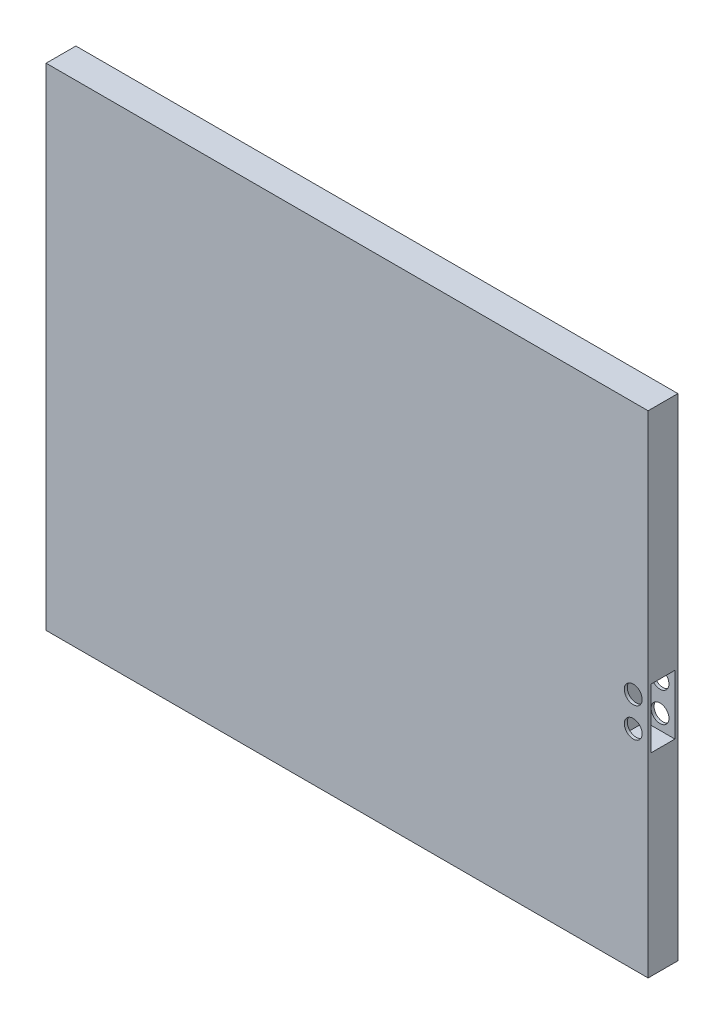
ISO-10303-21;
HEADER;
FILE_DESCRIPTION(('STEP AP214'),'2;1');
FILE_NAME('part.step','',(''),(''),'','','');
FILE_SCHEMA(('AUTOMOTIVE_DESIGN { 1 0 10303 214 1 1 1 1 }'));
ENDSEC;
DATA;
#1=APPLICATION_CONTEXT('core data for automotive mechanical design processes');
#2=APPLICATION_PROTOCOL_DEFINITION('international standard','automotive_design',2000,#1);
#3=PRODUCT_CONTEXT('',#1,'mechanical');
#4=PRODUCT('Part','Part','',(#3));
#5=PRODUCT_RELATED_PRODUCT_CATEGORY('part','',(#4));
#6=PRODUCT_DEFINITION_FORMATION('','',#4);
#7=PRODUCT_DEFINITION_CONTEXT('part definition',#1,'design');
#8=PRODUCT_DEFINITION('design','',#6,#7);
#9=PRODUCT_DEFINITION_SHAPE('','',#8);
#10=(LENGTH_UNIT() NAMED_UNIT(*) SI_UNIT(.MILLI.,.METRE.));
#11=(NAMED_UNIT(*) PLANE_ANGLE_UNIT() SI_UNIT($,.RADIAN.));
#12=(NAMED_UNIT(*) SI_UNIT($,.STERADIAN.) SOLID_ANGLE_UNIT());
#13=UNCERTAINTY_MEASURE_WITH_UNIT(LENGTH_MEASURE(1.E-05),#10,'distance_accuracy_value','');
#14=(GEOMETRIC_REPRESENTATION_CONTEXT(3) GLOBAL_UNCERTAINTY_ASSIGNED_CONTEXT((#13)) GLOBAL_UNIT_ASSIGNED_CONTEXT((#10,
#11,#12)) REPRESENTATION_CONTEXT('',''));
#15=CARTESIAN_POINT('',(0.,0.,0.));
#16=DIRECTION('',(0.,0.,1.));
#17=DIRECTION('',(1.,0.,0.));
#18=AXIS2_PLACEMENT_3D('',#15,#16,#17);
#19=CARTESIAN_POINT('',(-78.2272300469483,89.1981220657277,12.7));
#20=DIRECTION('',(1.,0.,0.));
#21=DIRECTION('',(0.,1.,0.));
#22=AXIS2_PLACEMENT_3D('',#19,#20,#21);
#23=PLANE('',#22);
#24=DIRECTION('',(0.,-1.,0.));
#25=VECTOR('',#24,1.);
#26=CARTESIAN_POINT('',(-78.2272300469483,89.1981220657277,0.));
#27=LINE('',#26,#25);
#28=CARTESIAN_POINT('',(-78.2272300469483,101.898122065728,0.));
#29=VERTEX_POINT('',#28);
#30=CARTESIAN_POINT('',(-78.2272300469483,-107.651877934272,0.));
#31=VERTEX_POINT('',#30);
#32=EDGE_CURVE('E85',#29,#31,#27,.T.);
#33=ORIENTED_EDGE('',*,*,#32,.T.);
#34=DIRECTION('',(0.,0.,-1.));
#35=VECTOR('',#34,1.);
#36=CARTESIAN_POINT('',(-78.2272300469483,-107.651877934272,12.7));
#37=LINE('',#36,#35);
#38=CARTESIAN_POINT('',(-78.2272300469483,-107.651877934272,12.7));
#39=VERTEX_POINT('',#38);
#40=EDGE_CURVE('E11',#39,#31,#37,.T.);
#41=ORIENTED_EDGE('',*,*,#40,.F.);
#42=DIRECTION('',(0.,-1.,0.));
#43=VECTOR('',#42,1.);
#44=CARTESIAN_POINT('',(-78.2272300469483,89.1981220657277,12.7));
#45=LINE('',#44,#43);
#46=CARTESIAN_POINT('',(-78.2272300469483,101.898122065728,12.7));
#47=VERTEX_POINT('',#46);
#48=EDGE_CURVE('E99',#47,#39,#45,.T.);
#49=ORIENTED_EDGE('',*,*,#48,.F.);
#50=DIRECTION('',(0.,0.,1.));
#51=VECTOR('',#50,1.);
#52=CARTESIAN_POINT('',(-78.2272300469483,101.898122065728,0.));
#53=LINE('',#52,#51);
#54=EDGE_CURVE('E168',#29,#47,#53,.T.);
#55=ORIENTED_EDGE('',*,*,#54,.F.);
#56=EDGE_LOOP('',(#33,#41,#49,#55));
#57=FACE_BOUND('',#56,.T.);
#58=ADVANCED_FACE('F39',(#57),#23,.F.);
#59=CARTESIAN_POINT('',(-78.2272300469483,-107.651877934272,12.7));
#60=DIRECTION('',(0.,1.,0.));
#61=DIRECTION('',(0.,0.,1.));
#62=AXIS2_PLACEMENT_3D('',#59,#60,#61);
#63=PLANE('',#62);
#64=DIRECTION('',(1.,0.,0.));
#65=VECTOR('',#64,1.);
#66=CARTESIAN_POINT('',(-78.2272300469483,-107.651877934272,0.));
#67=LINE('',#66,#65);
#68=CARTESIAN_POINT('',(178.566769953052,-107.651877934272,0.));
#69=VERTEX_POINT('',#68);
#70=EDGE_CURVE('E75',#31,#69,#67,.T.);
#71=ORIENTED_EDGE('',*,*,#70,.T.);
#72=DIRECTION('',(0.,0.,-1.));
#73=VECTOR('',#72,1.);
#74=CARTESIAN_POINT('',(178.566769953052,-107.651877934272,12.7));
#75=LINE('',#74,#73);
#76=CARTESIAN_POINT('',(178.566769953052,-107.651877934272,12.7));
#77=VERTEX_POINT('',#76);
#78=EDGE_CURVE('E47',#77,#69,#75,.T.);
#79=ORIENTED_EDGE('',*,*,#78,.F.);
#80=DIRECTION('',(1.,0.,0.));
#81=VECTOR('',#80,1.);
#82=CARTESIAN_POINT('',(-78.2272300469483,-107.651877934272,12.7));
#83=LINE('',#82,#81);
#84=EDGE_CURVE('E64',#39,#77,#83,.T.);
#85=ORIENTED_EDGE('',*,*,#84,.F.);
#86=ORIENTED_EDGE('',*,*,#40,.T.);
#87=EDGE_LOOP('',(#71,#79,#85,#86));
#88=FACE_BOUND('',#87,.T.);
#89=ADVANCED_FACE('F77',(#88),#63,.F.);
#90=CARTESIAN_POINT('',(178.566769953052,89.1981220657277,12.7));
#91=DIRECTION('',(-1.,0.,0.));
#92=DIRECTION('',(0.,0.,1.));
#93=AXIS2_PLACEMENT_3D('',#90,#91,#92);
#94=PLANE('',#93);
#95=DIRECTION('',(0.,0.,-1.));
#96=VECTOR('',#95,1.);
#97=CARTESIAN_POINT('',(178.566769953052,-25.0939401241895,11.43));
#98=LINE('',#97,#96);
#99=CARTESIAN_POINT('',(178.566769953052,-25.0939401241895,11.43));
#100=VERTEX_POINT('',#99);
#101=CARTESIAN_POINT('',(178.566769953052,-25.0939401241895,1.26999999999999));
#102=VERTEX_POINT('',#101);
#103=EDGE_CURVE('E145',#100,#102,#98,.T.);
#104=ORIENTED_EDGE('',*,*,#103,.F.);
#105=DIRECTION('',(0.,-1.,0.));
#106=VECTOR('',#105,1.);
#107=CARTESIAN_POINT('',(178.566769953052,0.306059875810515,11.43));
#108=LINE('',#107,#106);
#109=CARTESIAN_POINT('',(178.566769953052,0.306059875810515,11.43));
#110=VERTEX_POINT('',#109);
#111=EDGE_CURVE('E55',#110,#100,#108,.T.);
#112=ORIENTED_EDGE('',*,*,#111,.F.);
#113=DIRECTION('',(0.,0.,1.));
#114=VECTOR('',#113,1.);
#115=CARTESIAN_POINT('',(178.566769953052,0.306059875810515,11.43));
#116=LINE('',#115,#114);
#117=CARTESIAN_POINT('',(178.566769953052,0.306059875810517,1.27));
#118=VERTEX_POINT('',#117);
#119=EDGE_CURVE('E134',#118,#110,#116,.T.);
#120=ORIENTED_EDGE('',*,*,#119,.F.);
#121=DIRECTION('',(0.,1.,0.));
#122=VECTOR('',#121,1.);
#123=CARTESIAN_POINT('',(178.566769953052,0.306059875810517,1.27));
#124=LINE('',#123,#122);
#125=EDGE_CURVE('E148',#102,#118,#124,.T.);
#126=ORIENTED_EDGE('',*,*,#125,.F.);
#127=EDGE_LOOP('',(#104,#112,#120,#126));
#128=FACE_BOUND('',#127,.T.);
#129=DIRECTION('',(0.,1.,0.));
#130=VECTOR('',#129,1.);
#131=CARTESIAN_POINT('',(178.566769953052,89.1981220657277,0.));
#132=LINE('',#131,#130);
#133=CARTESIAN_POINT('',(178.566769953052,101.898122065728,0.));
#134=VERTEX_POINT('',#133);
#135=EDGE_CURVE('E84',#69,#134,#132,.T.);
#136=ORIENTED_EDGE('',*,*,#135,.T.);
#137=DIRECTION('',(0.,0.,-1.));
#138=VECTOR('',#137,1.);
#139=CARTESIAN_POINT('',(178.566769953052,101.898122065728,0.));
#140=LINE('',#139,#138);
#141=CARTESIAN_POINT('',(178.566769953052,101.898122065728,12.7));
#142=VERTEX_POINT('',#141);
#143=EDGE_CURVE('E175',#142,#134,#140,.T.);
#144=ORIENTED_EDGE('',*,*,#143,.F.);
#145=DIRECTION('',(0.,1.,0.));
#146=VECTOR('',#145,1.);
#147=CARTESIAN_POINT('',(178.566769953052,89.1981220657277,12.7));
#148=LINE('',#147,#146);
#149=EDGE_CURVE('E93',#77,#142,#148,.T.);
#150=ORIENTED_EDGE('',*,*,#149,.F.);
#151=ORIENTED_EDGE('',*,*,#78,.T.);
#152=EDGE_LOOP('',(#136,#144,#150,#151));
#153=FACE_BOUND('',#152,.T.);
#154=ADVANCED_FACE('F89',(#128,#153),#94,.F.);
#155=CARTESIAN_POINT('',(0.,0.,12.7));
#156=DIRECTION('',(0.,0.,1.));
#157=DIRECTION('',(1.,0.,0.));
#158=AXIS2_PLACEMENT_3D('',#155,#156,#157);
#159=PLANE('',#158);
#160=CARTESIAN_POINT('',(172.216769953052,-6.04394012418949,12.7));
#161=DIRECTION('',(0.,0.,1.));
#162=DIRECTION('',(1.,0.,0.));
#163=AXIS2_PLACEMENT_3D('',#160,#161,#162);
#164=CIRCLE('',#163,3.81000000000001);
#165=CARTESIAN_POINT('',(176.026769953052,-6.04394012418949,12.7));
#166=VERTEX_POINT('',#165);
#167=EDGE_CURVE('E112',#166,#166,#164,.T.);
#168=ORIENTED_EDGE('',*,*,#167,.F.);
#169=EDGE_LOOP('',(#168));
#170=FACE_BOUND('',#169,.T.);
#171=CARTESIAN_POINT('',(172.216769953052,-18.7439401241895,12.7));
#172=DIRECTION('',(0.,0.,1.));
#173=DIRECTION('',(1.,0.,0.));
#174=AXIS2_PLACEMENT_3D('',#171,#172,#173);
#175=CIRCLE('',#174,3.81000000000001);
#176=CARTESIAN_POINT('',(176.026769953052,-18.7439401241895,12.7));
#177=VERTEX_POINT('',#176);
#178=EDGE_CURVE('E117',#177,#177,#175,.T.);
#179=ORIENTED_EDGE('',*,*,#178,.F.);
#180=EDGE_LOOP('',(#179));
#181=FACE_BOUND('',#180,.T.);
#182=ORIENTED_EDGE('',*,*,#48,.T.);
#183=ORIENTED_EDGE('',*,*,#84,.T.);
#184=ORIENTED_EDGE('',*,*,#149,.T.);
#185=DIRECTION('',(1.,0.,0.));
#186=VECTOR('',#185,1.);
#187=CARTESIAN_POINT('',(-78.2272300469483,101.898122065728,12.7));
#188=LINE('',#187,#186);
#189=EDGE_CURVE('E176',#47,#142,#188,.T.);
#190=ORIENTED_EDGE('',*,*,#189,.F.);
#191=EDGE_LOOP('',(#182,#183,#184,#190));
#192=FACE_BOUND('',#191,.T.);
#193=ADVANCED_FACE('F182',(#170,#181,#192),#159,.T.);
#194=CARTESIAN_POINT('',(0.,0.,0.));
#195=DIRECTION('',(0.,0.,1.));
#196=DIRECTION('',(1.,0.,0.));
#197=AXIS2_PLACEMENT_3D('',#194,#195,#196);
#198=PLANE('',#197);
#199=CARTESIAN_POINT('',(172.216769953052,-6.04394012418949,0.));
#200=DIRECTION('',(0.,0.,1.));
#201=DIRECTION('',(1.,0.,0.));
#202=AXIS2_PLACEMENT_3D('',#199,#200,#201);
#203=CIRCLE('',#202,3.81000000000001);
#204=CARTESIAN_POINT('',(176.026769953052,-6.04394012418949,0.));
#205=VERTEX_POINT('',#204);
#206=EDGE_CURVE('E106',#205,#205,#203,.T.);
#207=ORIENTED_EDGE('',*,*,#206,.T.);
#208=EDGE_LOOP('',(#207));
#209=FACE_BOUND('',#208,.T.);
#210=CARTESIAN_POINT('',(172.216769953052,-18.7439401241895,0.));
#211=DIRECTION('',(0.,0.,1.));
#212=DIRECTION('',(1.,0.,0.));
#213=AXIS2_PLACEMENT_3D('',#210,#211,#212);
#214=CIRCLE('',#213,3.81000000000001);
#215=CARTESIAN_POINT('',(176.026769953052,-18.7439401241895,0.));
#216=VERTEX_POINT('',#215);
#217=EDGE_CURVE('E124',#216,#216,#214,.T.);
#218=ORIENTED_EDGE('',*,*,#217,.T.);
#219=EDGE_LOOP('',(#218));
#220=FACE_BOUND('',#219,.T.);
#221=ORIENTED_EDGE('',*,*,#32,.F.);
#222=DIRECTION('',(-1.,0.,0.));
#223=VECTOR('',#222,1.);
#224=CARTESIAN_POINT('',(-78.2272300469483,101.898122065728,0.));
#225=LINE('',#224,#223);
#226=EDGE_CURVE('E98',#134,#29,#225,.T.);
#227=ORIENTED_EDGE('',*,*,#226,.F.);
#228=ORIENTED_EDGE('',*,*,#135,.F.);
#229=ORIENTED_EDGE('',*,*,#70,.F.);
#230=EDGE_LOOP('',(#221,#227,#228,#229));
#231=FACE_BOUND('',#230,.T.);
#232=ADVANCED_FACE('F96',(#209,#220,#231),#198,.F.);
#233=CARTESIAN_POINT('',(165.866769953052,0.306059875810515,11.43));
#234=DIRECTION('',(0.,0.,1.));
#235=DIRECTION('',(0.,-1.,0.));
#236=AXIS2_PLACEMENT_3D('',#233,#234,#235);
#237=PLANE('',#236);
#238=CARTESIAN_POINT('',(172.216769953052,-6.04394012418949,11.43));
#239=DIRECTION('',(0.,0.,1.));
#240=DIRECTION('',(0.,-1.,0.));
#241=AXIS2_PLACEMENT_3D('',#238,#239,#240);
#242=CIRCLE('',#241,3.81000000000001);
#243=CARTESIAN_POINT('',(172.216769953052,-9.8539401241895,11.43));
#244=VERTEX_POINT('',#243);
#245=EDGE_CURVE('E127',#244,#244,#242,.T.);
#246=ORIENTED_EDGE('',*,*,#245,.T.);
#247=EDGE_LOOP('',(#246));
#248=FACE_BOUND('',#247,.T.);
#249=CARTESIAN_POINT('',(172.216769953052,-18.7439401241895,11.43));
#250=DIRECTION('',(0.,0.,1.));
#251=DIRECTION('',(0.,-1.,0.));
#252=AXIS2_PLACEMENT_3D('',#249,#250,#251);
#253=CIRCLE('',#252,3.81000000000001);
#254=CARTESIAN_POINT('',(172.216769953052,-22.5539401241895,11.43));
#255=VERTEX_POINT('',#254);
#256=EDGE_CURVE('E105',#255,#255,#253,.T.);
#257=ORIENTED_EDGE('',*,*,#256,.T.);
#258=EDGE_LOOP('',(#257));
#259=FACE_BOUND('',#258,.T.);
#260=ORIENTED_EDGE('',*,*,#111,.T.);
#261=DIRECTION('',(1.,0.,0.));
#262=VECTOR('',#261,1.);
#263=CARTESIAN_POINT('',(165.866769953052,-25.0939401241895,11.43));
#264=LINE('',#263,#262);
#265=CARTESIAN_POINT('',(165.866769953052,-25.0939401241895,11.43));
#266=VERTEX_POINT('',#265);
#267=EDGE_CURVE('E143',#266,#100,#264,.T.);
#268=ORIENTED_EDGE('',*,*,#267,.F.);
#269=DIRECTION('',(0.,-1.,0.));
#270=VECTOR('',#269,1.);
#271=CARTESIAN_POINT('',(165.866769953052,0.306059875810515,11.43));
#272=LINE('',#271,#270);
#273=CARTESIAN_POINT('',(165.866769953052,0.306059875810515,11.43));
#274=VERTEX_POINT('',#273);
#275=EDGE_CURVE('E130',#274,#266,#272,.T.);
#276=ORIENTED_EDGE('',*,*,#275,.F.);
#277=DIRECTION('',(1.,0.,0.));
#278=VECTOR('',#277,1.);
#279=CARTESIAN_POINT('',(165.866769953052,0.306059875810515,11.43));
#280=LINE('',#279,#278);
#281=EDGE_CURVE('E153',#274,#110,#280,.T.);
#282=ORIENTED_EDGE('',*,*,#281,.T.);
#283=EDGE_LOOP('',(#260,#268,#276,#282));
#284=FACE_BOUND('',#283,.T.);
#285=ADVANCED_FACE('F200',(#248,#259,#284),#237,.F.);
#286=CARTESIAN_POINT('',(165.866769953052,0.306059875810515,11.43));
#287=DIRECTION('',(0.,1.,0.));
#288=DIRECTION('',(0.,0.,1.));
#289=AXIS2_PLACEMENT_3D('',#286,#287,#288);
#290=PLANE('',#289);
#291=ORIENTED_EDGE('',*,*,#119,.T.);
#292=ORIENTED_EDGE('',*,*,#281,.F.);
#293=DIRECTION('',(0.,0.,1.));
#294=VECTOR('',#293,1.);
#295=CARTESIAN_POINT('',(165.866769953052,0.306059875810515,11.43));
#296=LINE('',#295,#294);
#297=CARTESIAN_POINT('',(165.866769953052,0.306059875810517,1.27));
#298=VERTEX_POINT('',#297);
#299=EDGE_CURVE('E140',#298,#274,#296,.T.);
#300=ORIENTED_EDGE('',*,*,#299,.F.);
#301=DIRECTION('',(1.,0.,0.));
#302=VECTOR('',#301,1.);
#303=CARTESIAN_POINT('',(165.866769953052,0.306059875810517,1.27));
#304=LINE('',#303,#302);
#305=EDGE_CURVE('E155',#298,#118,#304,.T.);
#306=ORIENTED_EDGE('',*,*,#305,.T.);
#307=EDGE_LOOP('',(#291,#292,#300,#306));
#308=FACE_BOUND('',#307,.T.);
#309=ADVANCED_FACE('F204',(#308),#290,.F.);
#310=CARTESIAN_POINT('',(165.866769953052,0.306059875810517,1.27));
#311=DIRECTION('',(0.,0.,-1.));
#312=DIRECTION('',(0.,1.,0.));
#313=AXIS2_PLACEMENT_3D('',#310,#311,#312);
#314=PLANE('',#313);
#315=CARTESIAN_POINT('',(172.216769953052,-6.04394012418949,1.27));
#316=DIRECTION('',(0.,0.,-1.));
#317=DIRECTION('',(0.,1.,0.));
#318=AXIS2_PLACEMENT_3D('',#315,#316,#317);
#319=CIRCLE('',#318,3.81000000000001);
#320=CARTESIAN_POINT('',(172.216769953052,-2.23394012418948,1.27));
#321=VERTEX_POINT('',#320);
#322=EDGE_CURVE('E42',#321,#321,#319,.T.);
#323=ORIENTED_EDGE('',*,*,#322,.T.);
#324=EDGE_LOOP('',(#323));
#325=FACE_BOUND('',#324,.T.);
#326=CARTESIAN_POINT('',(172.216769953052,-18.7439401241895,1.26999999999999));
#327=DIRECTION('',(0.,0.,-1.));
#328=DIRECTION('',(0.,1.,0.));
#329=AXIS2_PLACEMENT_3D('',#326,#327,#328);
#330=CIRCLE('',#329,3.81000000000001);
#331=CARTESIAN_POINT('',(172.216769953052,-14.9339401241895,1.26999999999999));
#332=VERTEX_POINT('',#331);
#333=EDGE_CURVE('E103',#332,#332,#330,.T.);
#334=ORIENTED_EDGE('',*,*,#333,.T.);
#335=EDGE_LOOP('',(#334));
#336=FACE_BOUND('',#335,.T.);
#337=ORIENTED_EDGE('',*,*,#125,.T.);
#338=ORIENTED_EDGE('',*,*,#305,.F.);
#339=DIRECTION('',(0.,1.,0.));
#340=VECTOR('',#339,1.);
#341=CARTESIAN_POINT('',(165.866769953052,0.306059875810517,1.27));
#342=LINE('',#341,#340);
#343=CARTESIAN_POINT('',(165.866769953052,-25.0939401241895,1.26999999999999));
#344=VERTEX_POINT('',#343);
#345=EDGE_CURVE('E137',#344,#298,#342,.T.);
#346=ORIENTED_EDGE('',*,*,#345,.F.);
#347=DIRECTION('',(1.,0.,0.));
#348=VECTOR('',#347,1.);
#349=CARTESIAN_POINT('',(165.866769953052,-25.0939401241895,1.26999999999999));
#350=LINE('',#349,#348);
#351=EDGE_CURVE('E158',#344,#102,#350,.T.);
#352=ORIENTED_EDGE('',*,*,#351,.T.);
#353=EDGE_LOOP('',(#337,#338,#346,#352));
#354=FACE_BOUND('',#353,.T.);
#355=ADVANCED_FACE('F215',(#325,#336,#354),#314,.F.);
#356=CARTESIAN_POINT('',(165.866769953052,-25.0939401241895,11.43));
#357=DIRECTION('',(0.,-1.,0.));
#358=DIRECTION('',(0.,0.,-1.));
#359=AXIS2_PLACEMENT_3D('',#356,#357,#358);
#360=PLANE('',#359);
#361=ORIENTED_EDGE('',*,*,#103,.T.);
#362=ORIENTED_EDGE('',*,*,#351,.F.);
#363=DIRECTION('',(0.,0.,-1.));
#364=VECTOR('',#363,1.);
#365=CARTESIAN_POINT('',(165.866769953052,-25.0939401241895,11.43));
#366=LINE('',#365,#364);
#367=EDGE_CURVE('E133',#266,#344,#366,.T.);
#368=ORIENTED_EDGE('',*,*,#367,.F.);
#369=ORIENTED_EDGE('',*,*,#267,.T.);
#370=EDGE_LOOP('',(#361,#362,#368,#369));
#371=FACE_BOUND('',#370,.T.);
#372=ADVANCED_FACE('F209',(#371),#360,.F.);
#373=CARTESIAN_POINT('',(165.866769953052,0.,0.));
#374=DIRECTION('',(1.,0.,0.));
#375=DIRECTION('',(0.,0.,-1.));
#376=AXIS2_PLACEMENT_3D('',#373,#374,#375);
#377=PLANE('',#376);
#378=ORIENTED_EDGE('',*,*,#275,.T.);
#379=ORIENTED_EDGE('',*,*,#367,.T.);
#380=ORIENTED_EDGE('',*,*,#345,.T.);
#381=ORIENTED_EDGE('',*,*,#299,.T.);
#382=EDGE_LOOP('',(#378,#379,#380,#381));
#383=FACE_BOUND('',#382,.T.);
#384=ADVANCED_FACE('F213',(#383),#377,.T.);
#385=CARTESIAN_POINT('',(172.216769953052,-18.7439401241895,0.));
#386=DIRECTION('',(0.,0.,1.));
#387=DIRECTION('',(1.,0.,0.));
#388=AXIS2_PLACEMENT_3D('',#385,#386,#387);
#389=CYLINDRICAL_SURFACE('',#388,3.81000000000001);
#390=ORIENTED_EDGE('',*,*,#217,.F.);
#391=EDGE_LOOP('',(#390));
#392=FACE_BOUND('',#391,.T.);
#393=ORIENTED_EDGE('',*,*,#333,.F.);
#394=EDGE_LOOP('',(#393));
#395=FACE_BOUND('',#394,.T.);
#396=ADVANCED_FACE('F257',(#392,#395),#389,.F.);
#397=CARTESIAN_POINT('',(172.216769953052,-6.04394012418949,0.));
#398=DIRECTION('',(0.,0.,1.));
#399=DIRECTION('',(1.,0.,0.));
#400=AXIS2_PLACEMENT_3D('',#397,#398,#399);
#401=CYLINDRICAL_SURFACE('',#400,3.81000000000001);
#402=ORIENTED_EDGE('',*,*,#206,.F.);
#403=EDGE_LOOP('',(#402));
#404=FACE_BOUND('',#403,.T.);
#405=ORIENTED_EDGE('',*,*,#322,.F.);
#406=EDGE_LOOP('',(#405));
#407=FACE_BOUND('',#406,.T.);
#408=ADVANCED_FACE('F254',(#404,#407),#401,.F.);
#409=ORIENTED_EDGE('',*,*,#178,.T.);
#410=EDGE_LOOP('',(#409));
#411=FACE_BOUND('',#410,.T.);
#412=ORIENTED_EDGE('',*,*,#256,.F.);
#413=EDGE_LOOP('',(#412));
#414=FACE_BOUND('',#413,.T.);
#415=ADVANCED_FACE('F251',(#411,#414),#389,.F.);
#416=ORIENTED_EDGE('',*,*,#167,.T.);
#417=EDGE_LOOP('',(#416));
#418=FACE_BOUND('',#417,.T.);
#419=ORIENTED_EDGE('',*,*,#245,.F.);
#420=EDGE_LOOP('',(#419));
#421=FACE_BOUND('',#420,.T.);
#422=ADVANCED_FACE('F253',(#418,#421),#401,.F.);
#423=CARTESIAN_POINT('',(0.,101.898122065728,0.));
#424=DIRECTION('',(0.,1.,0.));
#425=DIRECTION('',(0.,0.,1.));
#426=AXIS2_PLACEMENT_3D('',#423,#424,#425);
#427=PLANE('',#426);
#428=ORIENTED_EDGE('',*,*,#54,.T.);
#429=ORIENTED_EDGE('',*,*,#189,.T.);
#430=ORIENTED_EDGE('',*,*,#143,.T.);
#431=ORIENTED_EDGE('',*,*,#226,.T.);
#432=EDGE_LOOP('',(#428,#429,#430,#431));
#433=FACE_BOUND('',#432,.T.);
#434=ADVANCED_FACE('F172',(#433),#427,.T.);
#435=CLOSED_SHELL('',(#58,#89,#154,#193,#232,#285,#309,#355,#372,#384,#396,#408,#415,#422,#434));
#436=MANIFOLD_SOLID_BREP('B2',#435);
#437=ADVANCED_BREP_SHAPE_REPRESENTATION('',(#18,#436),#14);
#438=SHAPE_DEFINITION_REPRESENTATION(#9,#437);
ENDSEC;
END-ISO-10303-21;
